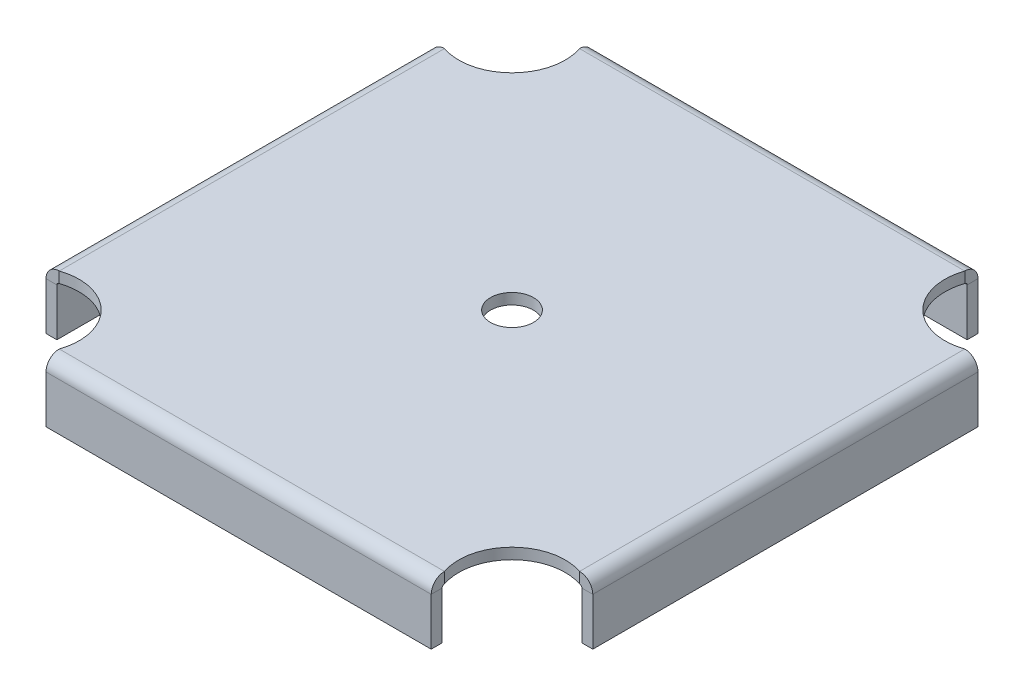
ISO-10303-21;
HEADER;
FILE_DESCRIPTION(('STEP AP214'),'2;1');
FILE_NAME('part.step','',(''),(''),'','','');
FILE_SCHEMA(('AUTOMOTIVE_DESIGN { 1 0 10303 214 1 1 1 1 }'));
ENDSEC;
DATA;
#1=APPLICATION_CONTEXT('core data for automotive mechanical design processes');
#2=APPLICATION_PROTOCOL_DEFINITION('international standard','automotive_design',2000,#1);
#3=PRODUCT_CONTEXT('',#1,'mechanical');
#4=PRODUCT('Part','Part','',(#3));
#5=PRODUCT_RELATED_PRODUCT_CATEGORY('part','',(#4));
#6=PRODUCT_DEFINITION_FORMATION('','',#4);
#7=PRODUCT_DEFINITION_CONTEXT('part definition',#1,'design');
#8=PRODUCT_DEFINITION('design','',#6,#7);
#9=PRODUCT_DEFINITION_SHAPE('','',#8);
#10=(LENGTH_UNIT() NAMED_UNIT(*) SI_UNIT(.MILLI.,.METRE.));
#11=(NAMED_UNIT(*) PLANE_ANGLE_UNIT() SI_UNIT($,.RADIAN.));
#12=(NAMED_UNIT(*) SI_UNIT($,.STERADIAN.) SOLID_ANGLE_UNIT());
#13=UNCERTAINTY_MEASURE_WITH_UNIT(LENGTH_MEASURE(1.E-05),#10,'distance_accuracy_value','');
#14=(GEOMETRIC_REPRESENTATION_CONTEXT(3) GLOBAL_UNCERTAINTY_ASSIGNED_CONTEXT((#13)) GLOBAL_UNIT_ASSIGNED_CONTEXT((#10,
#11,#12)) REPRESENTATION_CONTEXT('',''));
#15=CARTESIAN_POINT('',(0.,0.,0.));
#16=DIRECTION('',(0.,0.,1.));
#17=DIRECTION('',(1.,0.,0.));
#18=AXIS2_PLACEMENT_3D('',#15,#16,#17);
#19=CARTESIAN_POINT('',(76.2,-3.4163,76.2));
#20=DIRECTION('',(0.,1.,0.));
#21=DIRECTION('',(0.,0.,1.));
#22=AXIS2_PLACEMENT_3D('',#19,#20,#21);
#23=CYLINDRICAL_SURFACE('',#22,16.7005);
#24=CARTESIAN_POINT('',(76.2,0.,76.2));
#25=DIRECTION('',(0.,-1.,0.));
#26=DIRECTION('',(0.,0.,1.));
#27=AXIS2_PLACEMENT_3D('',#24,#25,#26);
#28=CIRCLE('',#27,16.7005);
#29=CARTESIAN_POINT('',(60.3828089759907,0.,81.5594));
#30=VERTEX_POINT('',#29);
#31=CARTESIAN_POINT('',(81.5594,0.,60.3828089759907));
#32=VERTEX_POINT('',#31);
#33=EDGE_CURVE('E462',#30,#32,#28,.T.);
#34=ORIENTED_EDGE('',*,*,#33,.F.);
#35=DIRECTION('',(0.,1.,0.));
#36=VECTOR('',#35,1.);
#37=CARTESIAN_POINT('',(60.3828089759907,-3.4163,81.5594));
#38=LINE('',#37,#36);
#39=CARTESIAN_POINT('',(60.3828089759907,-3.4163,81.5594));
#40=VERTEX_POINT('',#39);
#41=EDGE_CURVE('E13',#40,#30,#38,.T.);
#42=ORIENTED_EDGE('',*,*,#41,.F.);
#43=CARTESIAN_POINT('',(76.2,-3.4163,76.2));
#44=DIRECTION('',(0.,-1.,0.));
#45=DIRECTION('',(0.,0.,1.));
#46=AXIS2_PLACEMENT_3D('',#43,#44,#45);
#47=CIRCLE('',#46,16.7005);
#48=CARTESIAN_POINT('',(81.5594,-3.4163,60.3828089759907));
#49=VERTEX_POINT('',#48);
#50=EDGE_CURVE('E465',#40,#49,#47,.T.);
#51=ORIENTED_EDGE('',*,*,#50,.T.);
#52=DIRECTION('',(0.,1.,0.));
#53=VECTOR('',#52,1.);
#54=CARTESIAN_POINT('',(81.5594,-3.4163,60.3828089759907));
#55=LINE('',#54,#53);
#56=EDGE_CURVE('E119',#49,#32,#55,.T.);
#57=ORIENTED_EDGE('',*,*,#56,.T.);
#58=EDGE_LOOP('',(#34,#42,#51,#57));
#59=FACE_BOUND('',#58,.T.);
#60=ADVANCED_FACE('F116',(#59),#23,.F.);
#61=CARTESIAN_POINT('',(-76.2,-3.4163,76.2));
#62=DIRECTION('',(0.,1.,0.));
#63=DIRECTION('',(0.,0.,1.));
#64=AXIS2_PLACEMENT_3D('',#61,#62,#63);
#65=CYLINDRICAL_SURFACE('',#64,16.7005);
#66=CARTESIAN_POINT('',(-76.2,0.,76.2));
#67=DIRECTION('',(0.,-1.,0.));
#68=DIRECTION('',(0.,0.,1.));
#69=AXIS2_PLACEMENT_3D('',#66,#67,#68);
#70=CIRCLE('',#69,16.7005);
#71=CARTESIAN_POINT('',(-81.5594,0.,60.3828089759907));
#72=VERTEX_POINT('',#71);
#73=CARTESIAN_POINT('',(-60.3828089759907,0.,81.5594));
#74=VERTEX_POINT('',#73);
#75=EDGE_CURVE('E503',#72,#74,#70,.T.);
#76=ORIENTED_EDGE('',*,*,#75,.F.);
#77=DIRECTION('',(0.,1.,0.));
#78=VECTOR('',#77,1.);
#79=CARTESIAN_POINT('',(-81.5594,-3.4163,60.3828089759907));
#80=LINE('',#79,#78);
#81=CARTESIAN_POINT('',(-81.5594,-3.4163,60.3828089759907));
#82=VERTEX_POINT('',#81);
#83=EDGE_CURVE('E510',#82,#72,#80,.T.);
#84=ORIENTED_EDGE('',*,*,#83,.F.);
#85=CARTESIAN_POINT('',(-76.2,-3.4163,76.2));
#86=DIRECTION('',(0.,-1.,0.));
#87=DIRECTION('',(0.,0.,1.));
#88=AXIS2_PLACEMENT_3D('',#85,#86,#87);
#89=CIRCLE('',#88,16.7005);
#90=CARTESIAN_POINT('',(-60.3828089759907,-3.4163,81.5594));
#91=VERTEX_POINT('',#90);
#92=EDGE_CURVE('E481',#82,#91,#89,.T.);
#93=ORIENTED_EDGE('',*,*,#92,.T.);
#94=DIRECTION('',(0.,1.,0.));
#95=VECTOR('',#94,1.);
#96=CARTESIAN_POINT('',(-60.3828089759907,-3.4163,81.5594));
#97=LINE('',#96,#95);
#98=EDGE_CURVE('E124',#91,#74,#97,.T.);
#99=ORIENTED_EDGE('',*,*,#98,.T.);
#100=EDGE_LOOP('',(#76,#84,#93,#99));
#101=FACE_BOUND('',#100,.T.);
#102=ADVANCED_FACE('F542',(#101),#65,.F.);
#103=CARTESIAN_POINT('',(-76.2,-3.4163,-76.2));
#104=DIRECTION('',(0.,1.,0.));
#105=DIRECTION('',(0.,0.,1.));
#106=AXIS2_PLACEMENT_3D('',#103,#104,#105);
#107=CYLINDRICAL_SURFACE('',#106,16.7005);
#108=CARTESIAN_POINT('',(-76.2,0.,-76.2));
#109=DIRECTION('',(0.,-1.,0.));
#110=DIRECTION('',(0.,0.,1.));
#111=AXIS2_PLACEMENT_3D('',#108,#109,#110);
#112=CIRCLE('',#111,16.7005);
#113=CARTESIAN_POINT('',(-60.3828089759907,0.,-81.5594));
#114=VERTEX_POINT('',#113);
#115=CARTESIAN_POINT('',(-81.5594,0.,-60.3828089759907));
#116=VERTEX_POINT('',#115);
#117=EDGE_CURVE('E497',#114,#116,#112,.T.);
#118=ORIENTED_EDGE('',*,*,#117,.F.);
#119=DIRECTION('',(0.,1.,0.));
#120=VECTOR('',#119,1.);
#121=CARTESIAN_POINT('',(-60.3828089759907,-3.4163,-81.5594));
#122=LINE('',#121,#120);
#123=CARTESIAN_POINT('',(-60.3828089759907,-3.41630000000001,-81.5594));
#124=VERTEX_POINT('',#123);
#125=EDGE_CURVE('E515',#124,#114,#122,.T.);
#126=ORIENTED_EDGE('',*,*,#125,.F.);
#127=CARTESIAN_POINT('',(-76.2,-3.4163,-76.2));
#128=DIRECTION('',(0.,-1.,0.));
#129=DIRECTION('',(0.,0.,1.));
#130=AXIS2_PLACEMENT_3D('',#127,#128,#129);
#131=CIRCLE('',#130,16.7005);
#132=CARTESIAN_POINT('',(-81.5594,-3.4163,-60.3828089759907));
#133=VERTEX_POINT('',#132);
#134=EDGE_CURVE('E476',#124,#133,#131,.T.);
#135=ORIENTED_EDGE('',*,*,#134,.T.);
#136=DIRECTION('',(0.,1.,0.));
#137=VECTOR('',#136,1.);
#138=CARTESIAN_POINT('',(-81.5594,-3.4163,-60.3828089759907));
#139=LINE('',#138,#137);
#140=EDGE_CURVE('E512',#133,#116,#139,.T.);
#141=ORIENTED_EDGE('',*,*,#140,.T.);
#142=EDGE_LOOP('',(#118,#126,#135,#141));
#143=FACE_BOUND('',#142,.T.);
#144=ADVANCED_FACE('F587',(#143),#107,.F.);
#145=CARTESIAN_POINT('',(76.2,-3.4163,-76.2));
#146=DIRECTION('',(0.,1.,0.));
#147=DIRECTION('',(0.,0.,1.));
#148=AXIS2_PLACEMENT_3D('',#145,#146,#147);
#149=CYLINDRICAL_SURFACE('',#148,16.7005);
#150=CARTESIAN_POINT('',(76.2,0.,-76.2));
#151=DIRECTION('',(0.,-1.,0.));
#152=DIRECTION('',(0.,0.,1.));
#153=AXIS2_PLACEMENT_3D('',#150,#151,#152);
#154=CIRCLE('',#153,16.7005);
#155=CARTESIAN_POINT('',(81.5594,0.,-60.3828089759907));
#156=VERTEX_POINT('',#155);
#157=CARTESIAN_POINT('',(60.3828089759907,0.,-81.5594));
#158=VERTEX_POINT('',#157);
#159=EDGE_CURVE('E491',#156,#158,#154,.T.);
#160=ORIENTED_EDGE('',*,*,#159,.F.);
#161=DIRECTION('',(0.,1.,0.));
#162=VECTOR('',#161,1.);
#163=CARTESIAN_POINT('',(81.5594,-3.4163,-60.3828089759907));
#164=LINE('',#163,#162);
#165=CARTESIAN_POINT('',(81.5594,-3.4163,-60.3828089759907));
#166=VERTEX_POINT('',#165);
#167=EDGE_CURVE('E520',#166,#156,#164,.T.);
#168=ORIENTED_EDGE('',*,*,#167,.F.);
#169=CARTESIAN_POINT('',(76.2,-3.4163,-76.2));
#170=DIRECTION('',(0.,-1.,0.));
#171=DIRECTION('',(0.,0.,1.));
#172=AXIS2_PLACEMENT_3D('',#169,#170,#171);
#173=CIRCLE('',#172,16.7005);
#174=CARTESIAN_POINT('',(60.3828089759907,-3.41630000000001,-81.5594));
#175=VERTEX_POINT('',#174);
#176=EDGE_CURVE('E471',#166,#175,#173,.T.);
#177=ORIENTED_EDGE('',*,*,#176,.T.);
#178=DIRECTION('',(0.,1.,0.));
#179=VECTOR('',#178,1.);
#180=CARTESIAN_POINT('',(60.3828089759907,-3.4163,-81.5594));
#181=LINE('',#180,#179);
#182=EDGE_CURVE('E518',#175,#158,#181,.T.);
#183=ORIENTED_EDGE('',*,*,#182,.T.);
#184=EDGE_LOOP('',(#160,#168,#177,#183));
#185=FACE_BOUND('',#184,.T.);
#186=ADVANCED_FACE('F592',(#185),#149,.F.);
#187=CARTESIAN_POINT('',(76.2,-3.4163,76.2));
#188=DIRECTION('',(0.,1.,0.));
#189=DIRECTION('',(0.,0.,1.));
#190=AXIS2_PLACEMENT_3D('',#187,#188,#189);
#191=PLANE('',#190);
#192=CARTESIAN_POINT('',(0.,-3.4163,0.));
#193=DIRECTION('',(0.,1.,0.));
#194=DIRECTION('',(0.,0.,1.));
#195=AXIS2_PLACEMENT_3D('',#192,#193,#194);
#196=CIRCLE('',#195,6.7437);
#197=CARTESIAN_POINT('',(0.,-3.4163,6.7437));
#198=VERTEX_POINT('',#197);
#199=EDGE_CURVE('E459',#198,#198,#196,.T.);
#200=ORIENTED_EDGE('',*,*,#199,.T.);
#201=EDGE_LOOP('',(#200));
#202=FACE_BOUND('',#201,.T.);
#203=ORIENTED_EDGE('',*,*,#50,.F.);
#204=DIRECTION('',(1.,0.,0.));
#205=VECTOR('',#204,1.);
#206=CARTESIAN_POINT('',(60.3828089759907,-3.4163,81.5594));
#207=LINE('',#206,#205);
#208=EDGE_CURVE('E484',#91,#40,#207,.T.);
#209=ORIENTED_EDGE('',*,*,#208,.F.);
#210=ORIENTED_EDGE('',*,*,#92,.F.);
#211=DIRECTION('',(0.,0.,1.));
#212=VECTOR('',#211,1.);
#213=CARTESIAN_POINT('',(-81.5594,-3.4163,60.3828089759907));
#214=LINE('',#213,#212);
#215=EDGE_CURVE('E479',#133,#82,#214,.T.);
#216=ORIENTED_EDGE('',*,*,#215,.F.);
#217=ORIENTED_EDGE('',*,*,#134,.F.);
#218=DIRECTION('',(-1.,0.,0.));
#219=VECTOR('',#218,1.);
#220=CARTESIAN_POINT('',(-60.3828089759907,-3.4163,-81.5594));
#221=LINE('',#220,#219);
#222=EDGE_CURVE('E474',#175,#124,#221,.T.);
#223=ORIENTED_EDGE('',*,*,#222,.F.);
#224=ORIENTED_EDGE('',*,*,#176,.F.);
#225=DIRECTION('',(0.,0.,-1.));
#226=VECTOR('',#225,1.);
#227=CARTESIAN_POINT('',(81.5594,-3.4163,-60.3828089759907));
#228=LINE('',#227,#226);
#229=EDGE_CURVE('E468',#49,#166,#228,.T.);
#230=ORIENTED_EDGE('',*,*,#229,.F.);
#231=EDGE_LOOP('',(#203,#209,#210,#216,#217,#223,#224,#230));
#232=FACE_BOUND('',#231,.T.);
#233=ADVANCED_FACE('F548',(#202,#232),#191,.F.);
#234=CARTESIAN_POINT('',(76.2,0.,76.2));
#235=DIRECTION('',(0.,1.,0.));
#236=DIRECTION('',(0.,0.,1.));
#237=AXIS2_PLACEMENT_3D('',#234,#235,#236);
#238=PLANE('',#237);
#239=CARTESIAN_POINT('',(0.,0.,0.));
#240=DIRECTION('',(0.,1.,0.));
#241=DIRECTION('',(0.,0.,1.));
#242=AXIS2_PLACEMENT_3D('',#239,#240,#241);
#243=CIRCLE('',#242,6.7437);
#244=CARTESIAN_POINT('',(0.,0.,6.7437));
#245=VERTEX_POINT('',#244);
#246=EDGE_CURVE('E450',#245,#245,#243,.T.);
#247=ORIENTED_EDGE('',*,*,#246,.F.);
#248=EDGE_LOOP('',(#247));
#249=FACE_BOUND('',#248,.T.);
#250=ORIENTED_EDGE('',*,*,#33,.T.);
#251=DIRECTION('',(0.,0.,-1.));
#252=VECTOR('',#251,1.);
#253=CARTESIAN_POINT('',(81.5594,0.,-60.3828089759907));
#254=LINE('',#253,#252);
#255=EDGE_CURVE('E488',#32,#156,#254,.T.);
#256=ORIENTED_EDGE('',*,*,#255,.T.);
#257=ORIENTED_EDGE('',*,*,#159,.T.);
#258=DIRECTION('',(-1.,0.,0.));
#259=VECTOR('',#258,1.);
#260=CARTESIAN_POINT('',(-60.3828089759907,0.,-81.5594));
#261=LINE('',#260,#259);
#262=EDGE_CURVE('E494',#158,#114,#261,.T.);
#263=ORIENTED_EDGE('',*,*,#262,.T.);
#264=ORIENTED_EDGE('',*,*,#117,.T.);
#265=DIRECTION('',(0.,0.,1.));
#266=VECTOR('',#265,1.);
#267=CARTESIAN_POINT('',(-81.5594,0.,60.3828089759907));
#268=LINE('',#267,#266);
#269=EDGE_CURVE('E500',#116,#72,#268,.T.);
#270=ORIENTED_EDGE('',*,*,#269,.T.);
#271=ORIENTED_EDGE('',*,*,#75,.T.);
#272=DIRECTION('',(1.,0.,0.));
#273=VECTOR('',#272,1.);
#274=CARTESIAN_POINT('',(60.3828089759907,0.,81.5594));
#275=LINE('',#274,#273);
#276=EDGE_CURVE('E469',#74,#30,#275,.T.);
#277=ORIENTED_EDGE('',*,*,#276,.T.);
#278=EDGE_LOOP('',(#250,#256,#257,#263,#264,#270,#271,#277));
#279=FACE_BOUND('',#278,.T.);
#280=ADVANCED_FACE('F534',(#249,#279),#238,.T.);
#281=CARTESIAN_POINT('',(0.,-3.4163,0.));
#282=DIRECTION('',(0.,1.,0.));
#283=DIRECTION('',(0.,0.,1.));
#284=AXIS2_PLACEMENT_3D('',#281,#282,#283);
#285=CYLINDRICAL_SURFACE('',#284,6.7437);
#286=ORIENTED_EDGE('',*,*,#199,.F.);
#287=EDGE_LOOP('',(#286));
#288=FACE_BOUND('',#287,.T.);
#289=ORIENTED_EDGE('',*,*,#246,.T.);
#290=EDGE_LOOP('',(#289));
#291=FACE_BOUND('',#290,.T.);
#292=ADVANCED_FACE('F706',(#288,#291),#285,.F.);
#293=CARTESIAN_POINT('',(60.3828089759907,-4.1529,81.5594));
#294=DIRECTION('',(1.,0.,0.));
#295=DIRECTION('',(0.,0.,-1.));
#296=AXIS2_PLACEMENT_3D('',#293,#294,#295);
#297=PLANE('',#296);
#298=DIRECTION('',(0.,0.,1.));
#299=VECTOR('',#298,1.);
#300=CARTESIAN_POINT('',(60.3828089759907,-4.1529,85.7123));
#301=LINE('',#300,#299);
#302=CARTESIAN_POINT('',(60.3828089759907,-4.1529,82.296));
#303=VERTEX_POINT('',#302);
#304=CARTESIAN_POINT('',(60.3828089759907,-4.15289999999999,85.7123));
#305=VERTEX_POINT('',#304);
#306=EDGE_CURVE('E408',#303,#305,#301,.T.);
#307=ORIENTED_EDGE('',*,*,#306,.F.);
#308=CARTESIAN_POINT('',(60.3828089759907,-4.1529,81.5594));
#309=DIRECTION('',(-1.,0.,0.));
#310=DIRECTION('',(0.,0.,1.));
#311=AXIS2_PLACEMENT_3D('',#308,#309,#310);
#312=CIRCLE('',#311,0.736600000000004);
#313=EDGE_CURVE('E454',#40,#303,#312,.F.);
#314=ORIENTED_EDGE('',*,*,#313,.F.);
#315=ORIENTED_EDGE('',*,*,#41,.T.);
#316=CARTESIAN_POINT('',(60.3828089759907,-4.1529,81.5594));
#317=DIRECTION('',(-1.,0.,0.));
#318=DIRECTION('',(0.,0.,1.));
#319=AXIS2_PLACEMENT_3D('',#316,#317,#318);
#320=CIRCLE('',#319,4.1529);
#321=EDGE_CURVE('E132',#30,#305,#320,.F.);
#322=ORIENTED_EDGE('',*,*,#321,.T.);
#323=EDGE_LOOP('',(#307,#314,#315,#322));
#324=FACE_BOUND('',#323,.T.);
#325=ADVANCED_FACE('F555',(#324),#297,.T.);
#326=CARTESIAN_POINT('',(-60.3828089759907,-4.1529,81.5594));
#327=DIRECTION('',(1.,0.,0.));
#328=DIRECTION('',(0.,0.,-1.));
#329=AXIS2_PLACEMENT_3D('',#326,#327,#328);
#330=PLANE('',#329);
#331=CARTESIAN_POINT('',(-60.3828089759907,-4.1529,81.5594));
#332=DIRECTION('',(-1.,0.,0.));
#333=DIRECTION('',(0.,0.,1.));
#334=AXIS2_PLACEMENT_3D('',#331,#332,#333);
#335=CIRCLE('',#334,0.736600000000004);
#336=CARTESIAN_POINT('',(-60.3828089759907,-4.1529,82.296));
#337=VERTEX_POINT('',#336);
#338=EDGE_CURVE('E419',#337,#91,#335,.T.);
#339=ORIENTED_EDGE('',*,*,#338,.F.);
#340=DIRECTION('',(0.,0.,1.));
#341=VECTOR('',#340,1.);
#342=CARTESIAN_POINT('',(-60.3828089759907,-4.1529,82.296));
#343=LINE('',#342,#341);
#344=CARTESIAN_POINT('',(-60.3828089759907,-4.1529,85.7123));
#345=VERTEX_POINT('',#344);
#346=EDGE_CURVE('E442',#337,#345,#343,.T.);
#347=ORIENTED_EDGE('',*,*,#346,.T.);
#348=CARTESIAN_POINT('',(-60.3828089759907,-4.1529,81.5594));
#349=DIRECTION('',(-1.,0.,0.));
#350=DIRECTION('',(0.,0.,1.));
#351=AXIS2_PLACEMENT_3D('',#348,#349,#350);
#352=CIRCLE('',#351,4.1529);
#353=EDGE_CURVE('E451',#345,#74,#352,.T.);
#354=ORIENTED_EDGE('',*,*,#353,.T.);
#355=ORIENTED_EDGE('',*,*,#98,.F.);
#356=EDGE_LOOP('',(#339,#347,#354,#355));
#357=FACE_BOUND('',#356,.T.);
#358=ADVANCED_FACE('F539',(#357),#330,.F.);
#359=CARTESIAN_POINT('',(-60.3828089759907,-4.1529,81.5594));
#360=DIRECTION('',(-1.,0.,0.));
#361=DIRECTION('',(0.,0.,1.));
#362=AXIS2_PLACEMENT_3D('',#359,#360,#361);
#363=CYLINDRICAL_SURFACE('',#362,4.1529);
#364=ORIENTED_EDGE('',*,*,#276,.F.);
#365=ORIENTED_EDGE('',*,*,#353,.F.);
#366=DIRECTION('',(-1.,0.,0.));
#367=VECTOR('',#366,1.);
#368=CARTESIAN_POINT('',(0.,-4.1529,85.7123));
#369=LINE('',#368,#367);
#370=EDGE_CURVE('E439',#305,#345,#369,.T.);
#371=ORIENTED_EDGE('',*,*,#370,.F.);
#372=ORIENTED_EDGE('',*,*,#321,.F.);
#373=EDGE_LOOP('',(#364,#365,#371,#372));
#374=FACE_BOUND('',#373,.T.);
#375=ADVANCED_FACE('F536',(#374),#363,.T.);
#376=CARTESIAN_POINT('',(-60.3828089759907,-4.1529,81.5594));
#377=DIRECTION('',(-1.,0.,0.));
#378=DIRECTION('',(0.,0.,1.));
#379=AXIS2_PLACEMENT_3D('',#376,#377,#378);
#380=CYLINDRICAL_SURFACE('',#379,0.736600000000004);
#381=ORIENTED_EDGE('',*,*,#208,.T.);
#382=ORIENTED_EDGE('',*,*,#313,.T.);
#383=DIRECTION('',(1.,0.,0.));
#384=VECTOR('',#383,1.);
#385=CARTESIAN_POINT('',(60.3828089759907,-4.1529,82.296));
#386=LINE('',#385,#384);
#387=EDGE_CURVE('E445',#303,#337,#386,.F.);
#388=ORIENTED_EDGE('',*,*,#387,.T.);
#389=ORIENTED_EDGE('',*,*,#338,.T.);
#390=EDGE_LOOP('',(#381,#382,#388,#389));
#391=FACE_BOUND('',#390,.T.);
#392=ADVANCED_FACE('F552',(#391),#380,.F.);
#393=CARTESIAN_POINT('',(-60.3828089759907,-3.41629999999999,85.7123));
#394=DIRECTION('',(-1.,0.,0.));
#395=DIRECTION('',(0.,0.,1.));
#396=AXIS2_PLACEMENT_3D('',#393,#394,#395);
#397=PLANE('',#396);
#398=DIRECTION('',(0.,1.,0.));
#399=VECTOR('',#398,1.);
#400=CARTESIAN_POINT('',(-60.3828089759907,-3.41629999999999,85.7123));
#401=LINE('',#400,#399);
#402=CARTESIAN_POINT('',(-60.3828089759907,-19.05,85.7123));
#403=VERTEX_POINT('',#402);
#404=EDGE_CURVE('E423',#403,#345,#401,.T.);
#405=ORIENTED_EDGE('',*,*,#404,.T.);
#406=ORIENTED_EDGE('',*,*,#346,.F.);
#407=DIRECTION('',(0.,-1.,0.));
#408=VECTOR('',#407,1.);
#409=CARTESIAN_POINT('',(-60.3828089759907,2.17196961742773E-13,82.296));
#410=LINE('',#409,#408);
#411=CARTESIAN_POINT('',(-60.3828089759907,-19.05,82.296));
#412=VERTEX_POINT('',#411);
#413=EDGE_CURVE('E431',#412,#337,#410,.F.);
#414=ORIENTED_EDGE('',*,*,#413,.F.);
#415=DIRECTION('',(0.,0.,-1.));
#416=VECTOR('',#415,1.);
#417=CARTESIAN_POINT('',(-60.3828089759907,-19.05,85.7123));
#418=LINE('',#417,#416);
#419=EDGE_CURVE('E417',#403,#412,#418,.T.);
#420=ORIENTED_EDGE('',*,*,#419,.F.);
#421=EDGE_LOOP('',(#405,#406,#414,#420));
#422=FACE_BOUND('',#421,.T.);
#423=ADVANCED_FACE('F572',(#422),#397,.T.);
#424=CARTESIAN_POINT('',(60.3828089759907,-19.05,85.7123));
#425=DIRECTION('',(1.,0.,0.));
#426=DIRECTION('',(0.,0.,-1.));
#427=AXIS2_PLACEMENT_3D('',#424,#425,#426);
#428=PLANE('',#427);
#429=DIRECTION('',(0.,1.,0.));
#430=VECTOR('',#429,1.);
#431=CARTESIAN_POINT('',(60.3828089759907,2.17196961742773E-13,82.296));
#432=LINE('',#431,#430);
#433=CARTESIAN_POINT('',(60.3828089759907,-19.05,82.296));
#434=VERTEX_POINT('',#433);
#435=EDGE_CURVE('E437',#303,#434,#432,.F.);
#436=ORIENTED_EDGE('',*,*,#435,.F.);
#437=ORIENTED_EDGE('',*,*,#306,.T.);
#438=DIRECTION('',(0.,-1.,0.));
#439=VECTOR('',#438,1.);
#440=CARTESIAN_POINT('',(60.3828089759907,-19.05,85.7123));
#441=LINE('',#440,#439);
#442=CARTESIAN_POINT('',(60.3828089759907,-19.05,85.7123));
#443=VERTEX_POINT('',#442);
#444=EDGE_CURVE('E429',#305,#443,#441,.T.);
#445=ORIENTED_EDGE('',*,*,#444,.T.);
#446=DIRECTION('',(0.,0.,-1.));
#447=VECTOR('',#446,1.);
#448=CARTESIAN_POINT('',(60.3828089759907,-19.05,85.7123));
#449=LINE('',#448,#447);
#450=EDGE_CURVE('E420',#443,#434,#449,.T.);
#451=ORIENTED_EDGE('',*,*,#450,.T.);
#452=EDGE_LOOP('',(#436,#437,#445,#451));
#453=FACE_BOUND('',#452,.T.);
#454=ADVANCED_FACE('F559',(#453),#428,.T.);
#455=CARTESIAN_POINT('',(0.,2.29124909440663E-13,85.7123));
#456=DIRECTION('',(0.,0.,1.));
#457=DIRECTION('',(0.,-1.,0.));
#458=AXIS2_PLACEMENT_3D('',#455,#456,#457);
#459=PLANE('',#458);
#460=ORIENTED_EDGE('',*,*,#444,.F.);
#461=ORIENTED_EDGE('',*,*,#370,.T.);
#462=ORIENTED_EDGE('',*,*,#404,.F.);
#463=DIRECTION('',(-1.,0.,0.));
#464=VECTOR('',#463,1.);
#465=CARTESIAN_POINT('',(-60.3828089759907,-19.05,85.7123));
#466=LINE('',#465,#464);
#467=EDGE_CURVE('E426',#443,#403,#466,.T.);
#468=ORIENTED_EDGE('',*,*,#467,.F.);
#469=EDGE_LOOP('',(#460,#461,#462,#468));
#470=FACE_BOUND('',#469,.T.);
#471=ADVANCED_FACE('F563',(#470),#459,.T.);
#472=CARTESIAN_POINT('',(0.,2.17196961742773E-13,82.296));
#473=DIRECTION('',(0.,0.,1.));
#474=DIRECTION('',(0.,-1.,0.));
#475=AXIS2_PLACEMENT_3D('',#472,#473,#474);
#476=PLANE('',#475);
#477=ORIENTED_EDGE('',*,*,#387,.F.);
#478=ORIENTED_EDGE('',*,*,#435,.T.);
#479=DIRECTION('',(1.,0.,0.));
#480=VECTOR('',#479,1.);
#481=CARTESIAN_POINT('',(0.,-19.05,82.296));
#482=LINE('',#481,#480);
#483=EDGE_CURVE('E434',#434,#412,#482,.F.);
#484=ORIENTED_EDGE('',*,*,#483,.T.);
#485=ORIENTED_EDGE('',*,*,#413,.T.);
#486=EDGE_LOOP('',(#477,#478,#484,#485));
#487=FACE_BOUND('',#486,.T.);
#488=ADVANCED_FACE('F570',(#487),#476,.F.);
#489=CARTESIAN_POINT('',(-60.3828089759907,-19.05,85.7123));
#490=DIRECTION('',(0.,-1.,0.));
#491=DIRECTION('',(0.,0.,-1.));
#492=AXIS2_PLACEMENT_3D('',#489,#490,#491);
#493=PLANE('',#492);
#494=ORIENTED_EDGE('',*,*,#483,.F.);
#495=ORIENTED_EDGE('',*,*,#450,.F.);
#496=ORIENTED_EDGE('',*,*,#467,.T.);
#497=ORIENTED_EDGE('',*,*,#419,.T.);
#498=EDGE_LOOP('',(#494,#495,#496,#497));
#499=FACE_BOUND('',#498,.T.);
#500=ADVANCED_FACE('F567',(#499),#493,.T.);
#501=CARTESIAN_POINT('',(81.5594,-4.1529,-60.3828089759907));
#502=DIRECTION('',(0.,0.,-1.));
#503=DIRECTION('',(-1.,0.,0.));
#504=AXIS2_PLACEMENT_3D('',#501,#502,#503);
#505=PLANE('',#504);
#506=DIRECTION('',(1.,0.,0.));
#507=VECTOR('',#506,1.);
#508=CARTESIAN_POINT('',(85.7123,-4.15289999999999,-60.3828089759907));
#509=LINE('',#508,#507);
#510=CARTESIAN_POINT('',(82.296,-4.1529,-60.3828089759907));
#511=VERTEX_POINT('',#510);
#512=CARTESIAN_POINT('',(85.7123,-4.15289999999999,-60.3828089759907));
#513=VERTEX_POINT('',#512);
#514=EDGE_CURVE('E365',#511,#513,#509,.T.);
#515=ORIENTED_EDGE('',*,*,#514,.F.);
#516=CARTESIAN_POINT('',(81.5594,-4.1529,-60.3828089759907));
#517=DIRECTION('',(0.,0.,1.));
#518=DIRECTION('',(1.,0.,0.));
#519=AXIS2_PLACEMENT_3D('',#516,#517,#518);
#520=CIRCLE('',#519,0.736600000000004);
#521=EDGE_CURVE('E412',#166,#511,#520,.F.);
#522=ORIENTED_EDGE('',*,*,#521,.F.);
#523=ORIENTED_EDGE('',*,*,#167,.T.);
#524=CARTESIAN_POINT('',(81.5594,-4.1529,-60.3828089759907));
#525=DIRECTION('',(0.,0.,1.));
#526=DIRECTION('',(1.,0.,0.));
#527=AXIS2_PLACEMENT_3D('',#524,#525,#526);
#528=CIRCLE('',#527,4.1529);
#529=EDGE_CURVE('E405',#156,#513,#528,.F.);
#530=ORIENTED_EDGE('',*,*,#529,.T.);
#531=EDGE_LOOP('',(#515,#522,#523,#530));
#532=FACE_BOUND('',#531,.T.);
#533=ADVANCED_FACE('F689',(#532),#505,.T.);
#534=CARTESIAN_POINT('',(81.5594,-4.1529,60.3828089759907));
#535=DIRECTION('',(0.,0.,-1.));
#536=DIRECTION('',(-1.,0.,0.));
#537=AXIS2_PLACEMENT_3D('',#534,#535,#536);
#538=PLANE('',#537);
#539=CARTESIAN_POINT('',(81.5594,-4.1529,60.3828089759907));
#540=DIRECTION('',(0.,0.,1.));
#541=DIRECTION('',(1.,0.,0.));
#542=AXIS2_PLACEMENT_3D('',#539,#540,#541);
#543=CIRCLE('',#542,0.736600000000004);
#544=CARTESIAN_POINT('',(82.296,-4.1529,60.3828089759907));
#545=VERTEX_POINT('',#544);
#546=EDGE_CURVE('E376',#545,#49,#543,.T.);
#547=ORIENTED_EDGE('',*,*,#546,.F.);
#548=DIRECTION('',(1.,0.,0.));
#549=VECTOR('',#548,1.);
#550=CARTESIAN_POINT('',(82.296,-4.1529,60.3828089759907));
#551=LINE('',#550,#549);
#552=CARTESIAN_POINT('',(85.7123,-4.15289999999999,60.3828089759907));
#553=VERTEX_POINT('',#552);
#554=EDGE_CURVE('E398',#545,#553,#551,.T.);
#555=ORIENTED_EDGE('',*,*,#554,.T.);
#556=CARTESIAN_POINT('',(81.5594,-4.1529,60.3828089759907));
#557=DIRECTION('',(0.,0.,1.));
#558=DIRECTION('',(1.,0.,0.));
#559=AXIS2_PLACEMENT_3D('',#556,#557,#558);
#560=CIRCLE('',#559,4.1529);
#561=EDGE_CURVE('E409',#553,#32,#560,.T.);
#562=ORIENTED_EDGE('',*,*,#561,.T.);
#563=ORIENTED_EDGE('',*,*,#56,.F.);
#564=EDGE_LOOP('',(#547,#555,#562,#563));
#565=FACE_BOUND('',#564,.T.);
#566=ADVANCED_FACE('F684',(#565),#538,.F.);
#567=CARTESIAN_POINT('',(81.5594,-4.1529,60.3828089759907));
#568=DIRECTION('',(0.,0.,1.));
#569=DIRECTION('',(1.,0.,0.));
#570=AXIS2_PLACEMENT_3D('',#567,#568,#569);
#571=CYLINDRICAL_SURFACE('',#570,4.1529);
#572=ORIENTED_EDGE('',*,*,#255,.F.);
#573=ORIENTED_EDGE('',*,*,#561,.F.);
#574=DIRECTION('',(0.,0.,1.));
#575=VECTOR('',#574,1.);
#576=CARTESIAN_POINT('',(85.7123,-4.15289999999999,-60.3828089759907));
#577=LINE('',#576,#575);
#578=EDGE_CURVE('E396',#553,#513,#577,.F.);
#579=ORIENTED_EDGE('',*,*,#578,.T.);
#580=ORIENTED_EDGE('',*,*,#529,.F.);
#581=EDGE_LOOP('',(#572,#573,#579,#580));
#582=FACE_BOUND('',#581,.T.);
#583=ADVANCED_FACE('F681',(#582),#571,.T.);
#584=CARTESIAN_POINT('',(81.5594,-4.1529,60.3828089759907));
#585=DIRECTION('',(0.,0.,1.));
#586=DIRECTION('',(1.,0.,0.));
#587=AXIS2_PLACEMENT_3D('',#584,#585,#586);
#588=CYLINDRICAL_SURFACE('',#587,0.736600000000004);
#589=ORIENTED_EDGE('',*,*,#229,.T.);
#590=ORIENTED_EDGE('',*,*,#521,.T.);
#591=DIRECTION('',(0.,0.,1.));
#592=VECTOR('',#591,1.);
#593=CARTESIAN_POINT('',(82.296,-4.1529,-60.3828089759907));
#594=LINE('',#593,#592);
#595=EDGE_CURVE('E401',#511,#545,#594,.T.);
#596=ORIENTED_EDGE('',*,*,#595,.T.);
#597=ORIENTED_EDGE('',*,*,#546,.T.);
#598=EDGE_LOOP('',(#589,#590,#596,#597));
#599=FACE_BOUND('',#598,.T.);
#600=ADVANCED_FACE('F679',(#599),#588,.F.);
#601=CARTESIAN_POINT('',(85.7123,-3.41629999999999,-60.3828089759907));
#602=DIRECTION('',(0.,0.,-1.));
#603=DIRECTION('',(-1.,0.,0.));
#604=AXIS2_PLACEMENT_3D('',#601,#602,#603);
#605=PLANE('',#604);
#606=DIRECTION('',(0.,-1.,0.));
#607=VECTOR('',#606,1.);
#608=CARTESIAN_POINT('',(82.296,2.89595948990364E-13,-60.3828089759907));
#609=LINE('',#608,#607);
#610=CARTESIAN_POINT('',(82.2960000000001,-19.05,-60.3828089759907));
#611=VERTEX_POINT('',#610);
#612=EDGE_CURVE('E394',#511,#611,#609,.T.);
#613=ORIENTED_EDGE('',*,*,#612,.F.);
#614=ORIENTED_EDGE('',*,*,#514,.T.);
#615=DIRECTION('',(0.,1.,0.));
#616=VECTOR('',#615,1.);
#617=CARTESIAN_POINT('',(85.7123,-3.41629999999999,-60.3828089759907));
#618=LINE('',#617,#616);
#619=CARTESIAN_POINT('',(85.7123000000001,-19.05,-60.3828089759907));
#620=VERTEX_POINT('',#619);
#621=EDGE_CURVE('E386',#513,#620,#618,.F.);
#622=ORIENTED_EDGE('',*,*,#621,.T.);
#623=DIRECTION('',(-1.,0.,0.));
#624=VECTOR('',#623,1.);
#625=CARTESIAN_POINT('',(85.7123000000001,-19.05,-60.3828089759907));
#626=LINE('',#625,#624);
#627=EDGE_CURVE('E377',#620,#611,#626,.T.);
#628=ORIENTED_EDGE('',*,*,#627,.T.);
#629=EDGE_LOOP('',(#613,#614,#622,#628));
#630=FACE_BOUND('',#629,.T.);
#631=ADVANCED_FACE('F672',(#630),#605,.T.);
#632=CARTESIAN_POINT('',(85.7123000000001,-19.05,60.3828089759907));
#633=DIRECTION('',(0.,0.,1.));
#634=DIRECTION('',(0.,-1.,0.));
#635=AXIS2_PLACEMENT_3D('',#632,#633,#634);
#636=PLANE('',#635);
#637=DIRECTION('',(0.,-1.,0.));
#638=VECTOR('',#637,1.);
#639=CARTESIAN_POINT('',(85.7123000000001,-19.05,60.3828089759907));
#640=LINE('',#639,#638);
#641=CARTESIAN_POINT('',(85.7123000000001,-19.05,60.3828089759907));
#642=VERTEX_POINT('',#641);
#643=EDGE_CURVE('E380',#642,#553,#640,.F.);
#644=ORIENTED_EDGE('',*,*,#643,.T.);
#645=ORIENTED_EDGE('',*,*,#554,.F.);
#646=DIRECTION('',(0.,1.,0.));
#647=VECTOR('',#646,1.);
#648=CARTESIAN_POINT('',(82.296,3.16396380436809E-13,60.3828089759907));
#649=LINE('',#648,#647);
#650=CARTESIAN_POINT('',(82.2960000000001,-19.05,60.3828089759907));
#651=VERTEX_POINT('',#650);
#652=EDGE_CURVE('E388',#651,#545,#649,.T.);
#653=ORIENTED_EDGE('',*,*,#652,.F.);
#654=DIRECTION('',(-1.,0.,0.));
#655=VECTOR('',#654,1.);
#656=CARTESIAN_POINT('',(85.7123000000001,-19.05,60.3828089759907));
#657=LINE('',#656,#655);
#658=EDGE_CURVE('E374',#642,#651,#657,.T.);
#659=ORIENTED_EDGE('',*,*,#658,.F.);
#660=EDGE_LOOP('',(#644,#645,#653,#659));
#661=FACE_BOUND('',#660,.T.);
#662=ADVANCED_FACE('F665',(#661),#636,.T.);
#663=CARTESIAN_POINT('',(85.7123,3.01523896688254E-13,0.));
#664=DIRECTION('',(-1.,0.,0.));
#665=DIRECTION('',(0.,-1.,0.));
#666=AXIS2_PLACEMENT_3D('',#663,#664,#665);
#667=PLANE('',#666);
#668=ORIENTED_EDGE('',*,*,#578,.F.);
#669=ORIENTED_EDGE('',*,*,#643,.F.);
#670=DIRECTION('',(0.,0.,-1.));
#671=VECTOR('',#670,1.);
#672=CARTESIAN_POINT('',(85.7123000000001,-19.05,-60.3828089759907));
#673=LINE('',#672,#671);
#674=EDGE_CURVE('E383',#620,#642,#673,.F.);
#675=ORIENTED_EDGE('',*,*,#674,.F.);
#676=ORIENTED_EDGE('',*,*,#621,.F.);
#677=EDGE_LOOP('',(#668,#669,#675,#676));
#678=FACE_BOUND('',#677,.T.);
#679=ADVANCED_FACE('F661',(#678),#667,.F.);
#680=CARTESIAN_POINT('',(82.296,2.89595948990364E-13,0.));
#681=DIRECTION('',(-1.,0.,0.));
#682=DIRECTION('',(0.,-1.,0.));
#683=AXIS2_PLACEMENT_3D('',#680,#681,#682);
#684=PLANE('',#683);
#685=ORIENTED_EDGE('',*,*,#652,.T.);
#686=ORIENTED_EDGE('',*,*,#595,.F.);
#687=ORIENTED_EDGE('',*,*,#612,.T.);
#688=DIRECTION('',(0.,0.,1.));
#689=VECTOR('',#688,1.);
#690=CARTESIAN_POINT('',(82.2960000000001,-19.05,0.));
#691=LINE('',#690,#689);
#692=EDGE_CURVE('E391',#611,#651,#691,.T.);
#693=ORIENTED_EDGE('',*,*,#692,.T.);
#694=EDGE_LOOP('',(#685,#686,#687,#693));
#695=FACE_BOUND('',#694,.T.);
#696=ADVANCED_FACE('F664',(#695),#684,.T.);
#697=CARTESIAN_POINT('',(85.7123000000001,-19.05,-60.3828089759907));
#698=DIRECTION('',(0.,-1.,0.));
#699=DIRECTION('',(1.,0.,0.));
#700=AXIS2_PLACEMENT_3D('',#697,#698,#699);
#701=PLANE('',#700);
#702=ORIENTED_EDGE('',*,*,#692,.F.);
#703=ORIENTED_EDGE('',*,*,#627,.F.);
#704=ORIENTED_EDGE('',*,*,#674,.T.);
#705=ORIENTED_EDGE('',*,*,#658,.T.);
#706=EDGE_LOOP('',(#702,#703,#704,#705));
#707=FACE_BOUND('',#706,.T.);
#708=ADVANCED_FACE('F658',(#707),#701,.T.);
#709=CARTESIAN_POINT('',(-60.3828089759907,-4.15290000000001,-81.5594));
#710=DIRECTION('',(-1.,0.,0.));
#711=DIRECTION('',(0.,0.,1.));
#712=AXIS2_PLACEMENT_3D('',#709,#710,#711);
#713=PLANE('',#712);
#714=DIRECTION('',(0.,0.,-1.));
#715=VECTOR('',#714,1.);
#716=CARTESIAN_POINT('',(-60.3828089759907,-4.15289999999998,-85.7123));
#717=LINE('',#716,#715);
#718=CARTESIAN_POINT('',(-60.3828089759907,-4.15290000000001,-82.296));
#719=VERTEX_POINT('',#718);
#720=CARTESIAN_POINT('',(-60.3828089759907,-4.1529,-85.7123));
#721=VERTEX_POINT('',#720);
#722=EDGE_CURVE('E322',#719,#721,#717,.T.);
#723=ORIENTED_EDGE('',*,*,#722,.F.);
#724=CARTESIAN_POINT('',(-60.3828089759907,-4.15290000000001,-81.5594));
#725=DIRECTION('',(1.,0.,0.));
#726=DIRECTION('',(0.,0.,-1.));
#727=AXIS2_PLACEMENT_3D('',#724,#725,#726);
#728=CIRCLE('',#727,0.736600000000004);
#729=EDGE_CURVE('E369',#124,#719,#728,.F.);
#730=ORIENTED_EDGE('',*,*,#729,.F.);
#731=ORIENTED_EDGE('',*,*,#125,.T.);
#732=CARTESIAN_POINT('',(-60.3828089759907,-4.15290000000001,-81.5594));
#733=DIRECTION('',(1.,0.,0.));
#734=DIRECTION('',(0.,0.,-1.));
#735=AXIS2_PLACEMENT_3D('',#732,#733,#734);
#736=CIRCLE('',#735,4.1529);
#737=EDGE_CURVE('E362',#114,#721,#736,.F.);
#738=ORIENTED_EDGE('',*,*,#737,.T.);
#739=EDGE_LOOP('',(#723,#730,#731,#738));
#740=FACE_BOUND('',#739,.T.);
#741=ADVANCED_FACE('F629',(#740),#713,.T.);
#742=CARTESIAN_POINT('',(60.3828089759907,-4.15290000000001,-81.5594));
#743=DIRECTION('',(-1.,0.,0.));
#744=DIRECTION('',(0.,0.,1.));
#745=AXIS2_PLACEMENT_3D('',#742,#743,#744);
#746=PLANE('',#745);
#747=CARTESIAN_POINT('',(60.3828089759907,-4.15290000000001,-81.5594));
#748=DIRECTION('',(1.,0.,0.));
#749=DIRECTION('',(0.,0.,-1.));
#750=AXIS2_PLACEMENT_3D('',#747,#748,#749);
#751=CIRCLE('',#750,0.736600000000004);
#752=CARTESIAN_POINT('',(60.3828089759907,-4.15290000000001,-82.296));
#753=VERTEX_POINT('',#752);
#754=EDGE_CURVE('E333',#753,#175,#751,.T.);
#755=ORIENTED_EDGE('',*,*,#754,.F.);
#756=DIRECTION('',(0.,0.,-1.));
#757=VECTOR('',#756,1.);
#758=CARTESIAN_POINT('',(60.3828089759907,-4.15290000000001,-82.296));
#759=LINE('',#758,#757);
#760=CARTESIAN_POINT('',(60.3828089759907,-4.15289999999999,-85.7123));
#761=VERTEX_POINT('',#760);
#762=EDGE_CURVE('E355',#753,#761,#759,.T.);
#763=ORIENTED_EDGE('',*,*,#762,.T.);
#764=CARTESIAN_POINT('',(60.3828089759907,-4.15290000000001,-81.5594));
#765=DIRECTION('',(1.,0.,0.));
#766=DIRECTION('',(0.,0.,-1.));
#767=AXIS2_PLACEMENT_3D('',#764,#765,#766);
#768=CIRCLE('',#767,4.1529);
#769=EDGE_CURVE('E366',#761,#158,#768,.T.);
#770=ORIENTED_EDGE('',*,*,#769,.T.);
#771=ORIENTED_EDGE('',*,*,#182,.F.);
#772=EDGE_LOOP('',(#755,#763,#770,#771));
#773=FACE_BOUND('',#772,.T.);
#774=ADVANCED_FACE('F609',(#773),#746,.F.);
#775=CARTESIAN_POINT('',(60.3828089759907,-4.15290000000001,-81.5594));
#776=DIRECTION('',(1.,0.,0.));
#777=DIRECTION('',(0.,0.,-1.));
#778=AXIS2_PLACEMENT_3D('',#775,#776,#777);
#779=CYLINDRICAL_SURFACE('',#778,4.1529);
#780=ORIENTED_EDGE('',*,*,#262,.F.);
#781=ORIENTED_EDGE('',*,*,#769,.F.);
#782=DIRECTION('',(1.,0.,0.));
#783=VECTOR('',#782,1.);
#784=CARTESIAN_POINT('',(-60.3828089759907,-4.15289999999998,-85.7123));
#785=LINE('',#784,#783);
#786=EDGE_CURVE('E353',#761,#721,#785,.F.);
#787=ORIENTED_EDGE('',*,*,#786,.T.);
#788=ORIENTED_EDGE('',*,*,#737,.F.);
#789=EDGE_LOOP('',(#780,#781,#787,#788));
#790=FACE_BOUND('',#789,.T.);
#791=ADVANCED_FACE('F606',(#790),#779,.T.);
#792=CARTESIAN_POINT('',(60.3828089759907,-4.15290000000001,-81.5594));
#793=DIRECTION('',(1.,0.,0.));
#794=DIRECTION('',(0.,0.,-1.));
#795=AXIS2_PLACEMENT_3D('',#792,#793,#794);
#796=CYLINDRICAL_SURFACE('',#795,0.736600000000004);
#797=ORIENTED_EDGE('',*,*,#222,.T.);
#798=ORIENTED_EDGE('',*,*,#729,.T.);
#799=DIRECTION('',(1.,0.,0.));
#800=VECTOR('',#799,1.);
#801=CARTESIAN_POINT('',(-60.3828089759907,-4.1529,-82.296));
#802=LINE('',#801,#800);
#803=EDGE_CURVE('E358',#719,#753,#802,.T.);
#804=ORIENTED_EDGE('',*,*,#803,.T.);
#805=ORIENTED_EDGE('',*,*,#754,.T.);
#806=EDGE_LOOP('',(#797,#798,#804,#805));
#807=FACE_BOUND('',#806,.T.);
#808=ADVANCED_FACE('F633',(#807),#796,.F.);
#809=CARTESIAN_POINT('',(-60.3828089759907,-3.41629999999999,-85.7123));
#810=DIRECTION('',(-1.,0.,0.));
#811=DIRECTION('',(0.,0.,1.));
#812=AXIS2_PLACEMENT_3D('',#809,#810,#811);
#813=PLANE('',#812);
#814=DIRECTION('',(0.,-1.,0.));
#815=VECTOR('',#814,1.);
#816=CARTESIAN_POINT('',(-60.3828089759907,2.89595948990364E-13,-82.296));
#817=LINE('',#816,#815);
#818=CARTESIAN_POINT('',(-60.3828089759907,-19.05,-82.296));
#819=VERTEX_POINT('',#818);
#820=EDGE_CURVE('E351',#719,#819,#817,.T.);
#821=ORIENTED_EDGE('',*,*,#820,.F.);
#822=ORIENTED_EDGE('',*,*,#722,.T.);
#823=DIRECTION('',(0.,1.,0.));
#824=VECTOR('',#823,1.);
#825=CARTESIAN_POINT('',(-60.3828089759907,-3.41629999999999,-85.7123));
#826=LINE('',#825,#824);
#827=CARTESIAN_POINT('',(-60.3828089759907,-19.05,-85.7123));
#828=VERTEX_POINT('',#827);
#829=EDGE_CURVE('E343',#721,#828,#826,.F.);
#830=ORIENTED_EDGE('',*,*,#829,.T.);
#831=DIRECTION('',(0.,0.,1.));
#832=VECTOR('',#831,1.);
#833=CARTESIAN_POINT('',(-60.3828089759907,-19.05,-85.7123));
#834=LINE('',#833,#832);
#835=EDGE_CURVE('E334',#828,#819,#834,.T.);
#836=ORIENTED_EDGE('',*,*,#835,.T.);
#837=EDGE_LOOP('',(#821,#822,#830,#836));
#838=FACE_BOUND('',#837,.T.);
#839=ADVANCED_FACE('F626',(#838),#813,.T.);
#840=CARTESIAN_POINT('',(60.3828089759907,-19.05,-85.7123));
#841=DIRECTION('',(1.,0.,0.));
#842=DIRECTION('',(0.,1.,0.));
#843=AXIS2_PLACEMENT_3D('',#840,#841,#842);
#844=PLANE('',#843);
#845=DIRECTION('',(0.,-1.,0.));
#846=VECTOR('',#845,1.);
#847=CARTESIAN_POINT('',(60.3828089759907,-19.05,-85.7123));
#848=LINE('',#847,#846);
#849=CARTESIAN_POINT('',(60.3828089759907,-19.05,-85.7123));
#850=VERTEX_POINT('',#849);
#851=EDGE_CURVE('E337',#850,#761,#848,.F.);
#852=ORIENTED_EDGE('',*,*,#851,.T.);
#853=ORIENTED_EDGE('',*,*,#762,.F.);
#854=DIRECTION('',(0.,1.,0.));
#855=VECTOR('',#854,1.);
#856=CARTESIAN_POINT('',(60.3828089759907,3.16396380436809E-13,-82.2959999999999));
#857=LINE('',#856,#855);
#858=CARTESIAN_POINT('',(60.3828089759907,-19.05,-82.296));
#859=VERTEX_POINT('',#858);
#860=EDGE_CURVE('E345',#859,#753,#857,.T.);
#861=ORIENTED_EDGE('',*,*,#860,.F.);
#862=DIRECTION('',(0.,0.,1.));
#863=VECTOR('',#862,1.);
#864=CARTESIAN_POINT('',(60.3828089759907,-19.05,-85.7123));
#865=LINE('',#864,#863);
#866=EDGE_CURVE('E331',#850,#859,#865,.T.);
#867=ORIENTED_EDGE('',*,*,#866,.F.);
#868=EDGE_LOOP('',(#852,#853,#861,#867));
#869=FACE_BOUND('',#868,.T.);
#870=ADVANCED_FACE('F619',(#869),#844,.T.);
#871=CARTESIAN_POINT('',(0.,3.01523896688253E-13,-85.7123));
#872=DIRECTION('',(0.,0.,1.));
#873=DIRECTION('',(0.,-1.,0.));
#874=AXIS2_PLACEMENT_3D('',#871,#872,#873);
#875=PLANE('',#874);
#876=ORIENTED_EDGE('',*,*,#786,.F.);
#877=ORIENTED_EDGE('',*,*,#851,.F.);
#878=DIRECTION('',(-1.,0.,0.));
#879=VECTOR('',#878,1.);
#880=CARTESIAN_POINT('',(-60.3828089759907,-19.05,-85.7123));
#881=LINE('',#880,#879);
#882=EDGE_CURVE('E340',#828,#850,#881,.F.);
#883=ORIENTED_EDGE('',*,*,#882,.F.);
#884=ORIENTED_EDGE('',*,*,#829,.F.);
#885=EDGE_LOOP('',(#876,#877,#883,#884));
#886=FACE_BOUND('',#885,.T.);
#887=ADVANCED_FACE('F617',(#886),#875,.F.);
#888=CARTESIAN_POINT('',(0.,2.89595948990364E-13,-82.296));
#889=DIRECTION('',(0.,0.,1.));
#890=DIRECTION('',(0.,-1.,0.));
#891=AXIS2_PLACEMENT_3D('',#888,#889,#890);
#892=PLANE('',#891);
#893=ORIENTED_EDGE('',*,*,#860,.T.);
#894=ORIENTED_EDGE('',*,*,#803,.F.);
#895=ORIENTED_EDGE('',*,*,#820,.T.);
#896=DIRECTION('',(1.,0.,0.));
#897=VECTOR('',#896,1.);
#898=CARTESIAN_POINT('',(0.,-19.05,-82.296));
#899=LINE('',#898,#897);
#900=EDGE_CURVE('E348',#819,#859,#899,.T.);
#901=ORIENTED_EDGE('',*,*,#900,.T.);
#902=EDGE_LOOP('',(#893,#894,#895,#901));
#903=FACE_BOUND('',#902,.T.);
#904=ADVANCED_FACE('F636',(#903),#892,.T.);
#905=CARTESIAN_POINT('',(-60.3828089759907,-19.05,-85.7123));
#906=DIRECTION('',(0.,-1.,0.));
#907=DIRECTION('',(0.,0.,-1.));
#908=AXIS2_PLACEMENT_3D('',#905,#906,#907);
#909=PLANE('',#908);
#910=ORIENTED_EDGE('',*,*,#900,.F.);
#911=ORIENTED_EDGE('',*,*,#835,.F.);
#912=ORIENTED_EDGE('',*,*,#882,.T.);
#913=ORIENTED_EDGE('',*,*,#866,.T.);
#914=EDGE_LOOP('',(#910,#911,#912,#913));
#915=FACE_BOUND('',#914,.T.);
#916=ADVANCED_FACE('F622',(#915),#909,.T.);
#917=CARTESIAN_POINT('',(-81.5594,-4.1529,60.3828089759907));
#918=DIRECTION('',(0.,0.,1.));
#919=DIRECTION('',(1.,0.,0.));
#920=AXIS2_PLACEMENT_3D('',#917,#918,#919);
#921=PLANE('',#920);
#922=DIRECTION('',(-1.,0.,0.));
#923=VECTOR('',#922,1.);
#924=CARTESIAN_POINT('',(-85.7123,-4.15289999999999,60.3828089759907));
#925=LINE('',#924,#923);
#926=CARTESIAN_POINT('',(-82.296,-4.1529,60.3828089759907));
#927=VERTEX_POINT('',#926);
#928=CARTESIAN_POINT('',(-85.7123,-4.15289999999999,60.3828089759907));
#929=VERTEX_POINT('',#928);
#930=EDGE_CURVE('E318',#927,#929,#925,.T.);
#931=ORIENTED_EDGE('',*,*,#930,.F.);
#932=CARTESIAN_POINT('',(-81.5594,-4.1529,60.3828089759907));
#933=DIRECTION('',(0.,0.,-1.));
#934=DIRECTION('',(-1.,0.,0.));
#935=AXIS2_PLACEMENT_3D('',#932,#933,#934);
#936=CIRCLE('',#935,0.736600000000004);
#937=EDGE_CURVE('E326',#82,#927,#936,.F.);
#938=ORIENTED_EDGE('',*,*,#937,.F.);
#939=ORIENTED_EDGE('',*,*,#83,.T.);
#940=CARTESIAN_POINT('',(-81.5594,-4.1529,60.3828089759907));
#941=DIRECTION('',(0.,0.,-1.));
#942=DIRECTION('',(-1.,0.,0.));
#943=AXIS2_PLACEMENT_3D('',#940,#941,#942);
#944=CIRCLE('',#943,4.1529);
#945=EDGE_CURVE('E139',#72,#929,#944,.F.);
#946=ORIENTED_EDGE('',*,*,#945,.T.);
#947=EDGE_LOOP('',(#931,#938,#939,#946));
#948=FACE_BOUND('',#947,.T.);
#949=ADVANCED_FACE('F643',(#948),#921,.T.);
#950=CARTESIAN_POINT('',(-81.5594,-4.1529,-60.3828089759907));
#951=DIRECTION('',(0.,0.,1.));
#952=DIRECTION('',(1.,0.,0.));
#953=AXIS2_PLACEMENT_3D('',#950,#951,#952);
#954=PLANE('',#953);
#955=CARTESIAN_POINT('',(-81.5594,-4.1529,-60.3828089759907));
#956=DIRECTION('',(0.,0.,-1.));
#957=DIRECTION('',(-1.,0.,0.));
#958=AXIS2_PLACEMENT_3D('',#955,#956,#957);
#959=CIRCLE('',#958,0.736600000000004);
#960=CARTESIAN_POINT('',(-82.296,-4.1529,-60.3828089759907));
#961=VERTEX_POINT('',#960);
#962=EDGE_CURVE('E288',#961,#133,#959,.T.);
#963=ORIENTED_EDGE('',*,*,#962,.F.);
#964=DIRECTION('',(-1.,0.,0.));
#965=VECTOR('',#964,1.);
#966=CARTESIAN_POINT('',(-82.296,-4.1529,-60.3828089759907));
#967=LINE('',#966,#965);
#968=CARTESIAN_POINT('',(-85.7123,-4.15289999999999,-60.3828089759907));
#969=VERTEX_POINT('',#968);
#970=EDGE_CURVE('E313',#961,#969,#967,.T.);
#971=ORIENTED_EDGE('',*,*,#970,.T.);
#972=CARTESIAN_POINT('',(-81.5594,-4.1529,-60.3828089759907));
#973=DIRECTION('',(0.,0.,-1.));
#974=DIRECTION('',(-1.,0.,0.));
#975=AXIS2_PLACEMENT_3D('',#972,#973,#974);
#976=CIRCLE('',#975,4.1529);
#977=EDGE_CURVE('E323',#969,#116,#976,.T.);
#978=ORIENTED_EDGE('',*,*,#977,.T.);
#979=ORIENTED_EDGE('',*,*,#140,.F.);
#980=EDGE_LOOP('',(#963,#971,#978,#979));
#981=FACE_BOUND('',#980,.T.);
#982=ADVANCED_FACE('F952',(#981),#954,.F.);
#983=CARTESIAN_POINT('',(-81.5594,-4.1529,-60.3828089759907));
#984=DIRECTION('',(0.,0.,-1.));
#985=DIRECTION('',(-1.,0.,0.));
#986=AXIS2_PLACEMENT_3D('',#983,#984,#985);
#987=CYLINDRICAL_SURFACE('',#986,4.1529);
#988=ORIENTED_EDGE('',*,*,#269,.F.);
#989=ORIENTED_EDGE('',*,*,#977,.F.);
#990=DIRECTION('',(0.,0.,-1.));
#991=VECTOR('',#990,1.);
#992=CARTESIAN_POINT('',(-85.7123,-4.15289999999999,60.3828089759907));
#993=LINE('',#992,#991);
#994=EDGE_CURVE('E297',#969,#929,#993,.F.);
#995=ORIENTED_EDGE('',*,*,#994,.T.);
#996=ORIENTED_EDGE('',*,*,#945,.F.);
#997=EDGE_LOOP('',(#988,#989,#995,#996));
#998=FACE_BOUND('',#997,.T.);
#999=ADVANCED_FACE('F963',(#998),#987,.T.);
#1000=CARTESIAN_POINT('',(-81.5594,-4.1529,-60.3828089759907));
#1001=DIRECTION('',(0.,0.,-1.));
#1002=DIRECTION('',(-1.,0.,0.));
#1003=AXIS2_PLACEMENT_3D('',#1000,#1001,#1002);
#1004=CYLINDRICAL_SURFACE('',#1003,0.736600000000004);
#1005=ORIENTED_EDGE('',*,*,#215,.T.);
#1006=ORIENTED_EDGE('',*,*,#937,.T.);
#1007=DIRECTION('',(0.,0.,-1.));
#1008=VECTOR('',#1007,1.);
#1009=CARTESIAN_POINT('',(-82.296,-4.1529,60.3828089759907));
#1010=LINE('',#1009,#1008);
#1011=EDGE_CURVE('E316',#927,#961,#1010,.T.);
#1012=ORIENTED_EDGE('',*,*,#1011,.T.);
#1013=ORIENTED_EDGE('',*,*,#962,.T.);
#1014=EDGE_LOOP('',(#1005,#1006,#1012,#1013));
#1015=FACE_BOUND('',#1014,.T.);
#1016=ADVANCED_FACE('F973',(#1015),#1004,.F.);
#1017=CARTESIAN_POINT('',(-85.7123,-3.41629999999999,60.3828089759907));
#1018=DIRECTION('',(0.,0.,1.));
#1019=DIRECTION('',(1.,0.,0.));
#1020=AXIS2_PLACEMENT_3D('',#1017,#1018,#1019);
#1021=PLANE('',#1020);
#1022=DIRECTION('',(0.,-1.,0.));
#1023=VECTOR('',#1022,1.);
#1024=CARTESIAN_POINT('',(-82.2959999999999,2.89595948990364E-13,60.3828089759907));
#1025=LINE('',#1024,#1023);
#1026=CARTESIAN_POINT('',(-82.296,-19.05,60.3828089759907));
#1027=VERTEX_POINT('',#1026);
#1028=EDGE_CURVE('E310',#927,#1027,#1025,.T.);
#1029=ORIENTED_EDGE('',*,*,#1028,.F.);
#1030=ORIENTED_EDGE('',*,*,#930,.T.);
#1031=DIRECTION('',(0.,1.,0.));
#1032=VECTOR('',#1031,1.);
#1033=CARTESIAN_POINT('',(-85.7123,-3.41629999999999,60.3828089759907));
#1034=LINE('',#1033,#1032);
#1035=CARTESIAN_POINT('',(-85.7123,-19.05,60.3828089759907));
#1036=VERTEX_POINT('',#1035);
#1037=EDGE_CURVE('E302',#929,#1036,#1034,.F.);
#1038=ORIENTED_EDGE('',*,*,#1037,.T.);
#1039=DIRECTION('',(1.,0.,0.));
#1040=VECTOR('',#1039,1.);
#1041=CARTESIAN_POINT('',(-85.7123,-19.05,60.3828089759907));
#1042=LINE('',#1041,#1040);
#1043=EDGE_CURVE('E289',#1036,#1027,#1042,.T.);
#1044=ORIENTED_EDGE('',*,*,#1043,.T.);
#1045=EDGE_LOOP('',(#1029,#1030,#1038,#1044));
#1046=FACE_BOUND('',#1045,.T.);
#1047=ADVANCED_FACE('F983',(#1046),#1021,.T.);
#1048=CARTESIAN_POINT('',(-85.7123,-19.05,-60.3828089759907));
#1049=DIRECTION('',(0.,0.,-1.));
#1050=DIRECTION('',(0.,1.,0.));
#1051=AXIS2_PLACEMENT_3D('',#1048,#1049,#1050);
#1052=PLANE('',#1051);
#1053=DIRECTION('',(0.,-1.,0.));
#1054=VECTOR('',#1053,1.);
#1055=CARTESIAN_POINT('',(-85.7123,-19.05,-60.3828089759907));
#1056=LINE('',#1055,#1054);
#1057=CARTESIAN_POINT('',(-85.7123,-19.05,-60.3828089759907));
#1058=VERTEX_POINT('',#1057);
#1059=EDGE_CURVE('E281',#1058,#969,#1056,.F.);
#1060=ORIENTED_EDGE('',*,*,#1059,.T.);
#1061=ORIENTED_EDGE('',*,*,#970,.F.);
#1062=DIRECTION('',(0.,1.,0.));
#1063=VECTOR('',#1062,1.);
#1064=CARTESIAN_POINT('',(-82.2959999999999,3.16396380436809E-13,-60.3828089759907));
#1065=LINE('',#1064,#1063);
#1066=CARTESIAN_POINT('',(-82.296,-19.05,-60.3828089759907));
#1067=VERTEX_POINT('',#1066);
#1068=EDGE_CURVE('E283',#1067,#961,#1065,.T.);
#1069=ORIENTED_EDGE('',*,*,#1068,.F.);
#1070=DIRECTION('',(1.,0.,0.));
#1071=VECTOR('',#1070,1.);
#1072=CARTESIAN_POINT('',(-85.7123,-19.05,-60.3828089759907));
#1073=LINE('',#1072,#1071);
#1074=EDGE_CURVE('E277',#1058,#1067,#1073,.T.);
#1075=ORIENTED_EDGE('',*,*,#1074,.F.);
#1076=EDGE_LOOP('',(#1060,#1061,#1069,#1075));
#1077=FACE_BOUND('',#1076,.T.);
#1078=ADVANCED_FACE('F279',(#1077),#1052,.T.);
#1079=CARTESIAN_POINT('',(-85.7123,3.01523896688253E-13,0.));
#1080=DIRECTION('',(1.,0.,0.));
#1081=DIRECTION('',(0.,1.,0.));
#1082=AXIS2_PLACEMENT_3D('',#1079,#1080,#1081);
#1083=PLANE('',#1082);
#1084=ORIENTED_EDGE('',*,*,#994,.F.);
#1085=ORIENTED_EDGE('',*,*,#1059,.F.);
#1086=DIRECTION('',(0.,0.,1.));
#1087=VECTOR('',#1086,1.);
#1088=CARTESIAN_POINT('',(-85.7123,-19.05,60.3828089759907));
#1089=LINE('',#1088,#1087);
#1090=EDGE_CURVE('E296',#1036,#1058,#1089,.F.);
#1091=ORIENTED_EDGE('',*,*,#1090,.F.);
#1092=ORIENTED_EDGE('',*,*,#1037,.F.);
#1093=EDGE_LOOP('',(#1084,#1085,#1091,#1092));
#1094=FACE_BOUND('',#1093,.T.);
#1095=ADVANCED_FACE('F294',(#1094),#1083,.F.);
#1096=CARTESIAN_POINT('',(-82.2959999999999,2.89595948990364E-13,0.));
#1097=DIRECTION('',(1.,0.,0.));
#1098=DIRECTION('',(0.,1.,0.));
#1099=AXIS2_PLACEMENT_3D('',#1096,#1097,#1098);
#1100=PLANE('',#1099);
#1101=ORIENTED_EDGE('',*,*,#1068,.T.);
#1102=ORIENTED_EDGE('',*,*,#1011,.F.);
#1103=ORIENTED_EDGE('',*,*,#1028,.T.);
#1104=DIRECTION('',(0.,0.,-1.));
#1105=VECTOR('',#1104,1.);
#1106=CARTESIAN_POINT('',(-82.296,-19.05,0.));
#1107=LINE('',#1106,#1105);
#1108=EDGE_CURVE('E308',#1027,#1067,#1107,.T.);
#1109=ORIENTED_EDGE('',*,*,#1108,.T.);
#1110=EDGE_LOOP('',(#1101,#1102,#1103,#1109));
#1111=FACE_BOUND('',#1110,.T.);
#1112=ADVANCED_FACE('F1013',(#1111),#1100,.T.);
#1113=CARTESIAN_POINT('',(-85.7123,-19.05,60.3828089759907));
#1114=DIRECTION('',(0.,-1.,0.));
#1115=DIRECTION('',(1.,0.,0.));
#1116=AXIS2_PLACEMENT_3D('',#1113,#1114,#1115);
#1117=PLANE('',#1116);
#1118=ORIENTED_EDGE('',*,*,#1108,.F.);
#1119=ORIENTED_EDGE('',*,*,#1043,.F.);
#1120=ORIENTED_EDGE('',*,*,#1090,.T.);
#1121=ORIENTED_EDGE('',*,*,#1074,.T.);
#1122=EDGE_LOOP('',(#1118,#1119,#1120,#1121));
#1123=FACE_BOUND('',#1122,.T.);
#1124=ADVANCED_FACE('F300',(#1123),#1117,.T.);
#1125=CLOSED_SHELL('',(#60,#102,#144,#186,#233,#280,#292,#325,#358,#375,#392,#423,#454,#471,
#488,#500,#533,#566,#583,#600,#631,#662,#679,#696,#708,#741,#774,#791,#808,#839,#870,#887,#904,
#916,#949,#982,#999,#1016,#1047,#1078,#1095,#1112,#1124));
#1126=MANIFOLD_SOLID_BREP('B2',#1125);
#1127=ADVANCED_BREP_SHAPE_REPRESENTATION('',(#18,#1126),#14);
#1128=SHAPE_DEFINITION_REPRESENTATION(#9,#1127);
ENDSEC;
END-ISO-10303-21;
